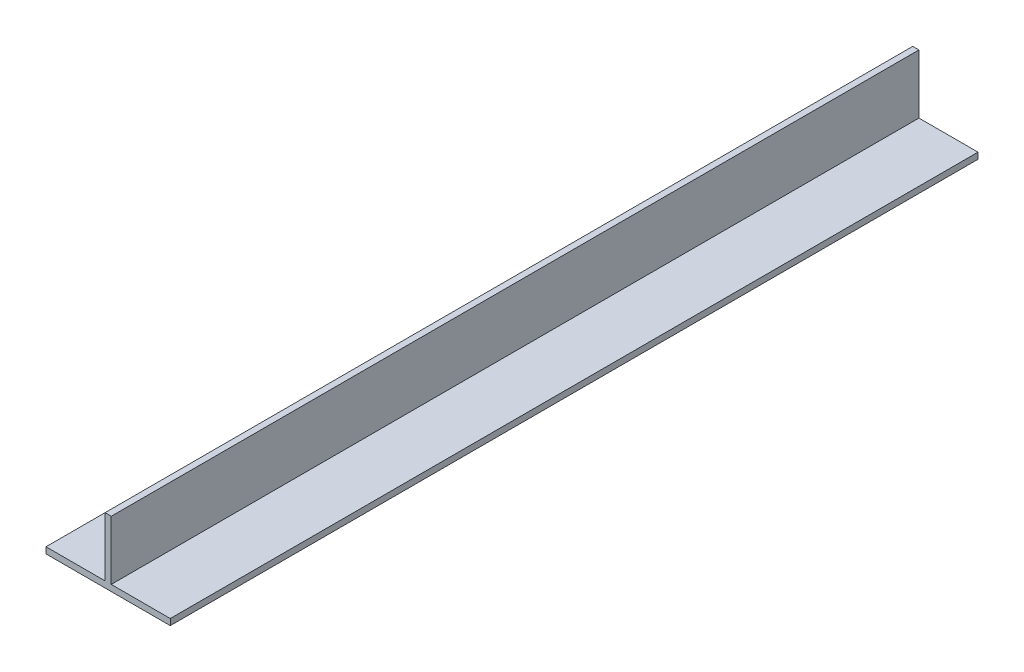
ISO-10303-21;
HEADER;
FILE_DESCRIPTION(('STEP AP214'),'2;1');
FILE_NAME('part.step','',(''),(''),'','','');
FILE_SCHEMA(('AUTOMOTIVE_DESIGN { 1 0 10303 214 1 1 1 1 }'));
ENDSEC;
DATA;
#1=APPLICATION_CONTEXT('core data for automotive mechanical design processes');
#2=APPLICATION_PROTOCOL_DEFINITION('international standard','automotive_design',2000,#1);
#3=PRODUCT_CONTEXT('',#1,'mechanical');
#4=PRODUCT('Part','Part','',(#3));
#5=PRODUCT_RELATED_PRODUCT_CATEGORY('part','',(#4));
#6=PRODUCT_DEFINITION_FORMATION('','',#4);
#7=PRODUCT_DEFINITION_CONTEXT('part definition',#1,'design');
#8=PRODUCT_DEFINITION('design','',#6,#7);
#9=PRODUCT_DEFINITION_SHAPE('','',#8);
#10=(LENGTH_UNIT() NAMED_UNIT(*) SI_UNIT(.MILLI.,.METRE.));
#11=(NAMED_UNIT(*) PLANE_ANGLE_UNIT() SI_UNIT($,.RADIAN.));
#12=(NAMED_UNIT(*) SI_UNIT($,.STERADIAN.) SOLID_ANGLE_UNIT());
#13=UNCERTAINTY_MEASURE_WITH_UNIT(LENGTH_MEASURE(1.E-05),#10,'distance_accuracy_value','');
#14=(GEOMETRIC_REPRESENTATION_CONTEXT(3) GLOBAL_UNCERTAINTY_ASSIGNED_CONTEXT((#13)) GLOBAL_UNIT_ASSIGNED_CONTEXT((#10,
#11,#12)) REPRESENTATION_CONTEXT('',''));
#15=CARTESIAN_POINT('',(0.,0.,0.));
#16=DIRECTION('',(0.,0.,1.));
#17=DIRECTION('',(1.,0.,0.));
#18=AXIS2_PLACEMENT_3D('',#15,#16,#17);
#19=CARTESIAN_POINT('',(10.,0.,65.));
#20=DIRECTION('',(-1.,0.,0.));
#21=DIRECTION('',(0.,0.,1.));
#22=AXIS2_PLACEMENT_3D('',#19,#20,#21);
#23=PLANE('',#22);
#24=DIRECTION('',(0.,1.,0.));
#25=VECTOR('',#24,1.);
#26=CARTESIAN_POINT('',(10.,0.,-65.));
#27=LINE('',#26,#25);
#28=CARTESIAN_POINT('',(10.,-1.,-65.));
#29=VERTEX_POINT('',#28);
#30=CARTESIAN_POINT('',(10.,0.,-65.));
#31=VERTEX_POINT('',#30);
#32=EDGE_CURVE('E128',#29,#31,#27,.T.);
#33=ORIENTED_EDGE('',*,*,#32,.T.);
#34=DIRECTION('',(0.,0.,-1.));
#35=VECTOR('',#34,1.);
#36=CARTESIAN_POINT('',(10.,0.,65.));
#37=LINE('',#36,#35);
#38=CARTESIAN_POINT('',(10.,0.,65.));
#39=VERTEX_POINT('',#38);
#40=EDGE_CURVE('E11',#39,#31,#37,.T.);
#41=ORIENTED_EDGE('',*,*,#40,.F.);
#42=DIRECTION('',(0.,1.,0.));
#43=VECTOR('',#42,1.);
#44=CARTESIAN_POINT('',(10.,0.,65.));
#45=LINE('',#44,#43);
#46=CARTESIAN_POINT('',(10.,-1.,65.));
#47=VERTEX_POINT('',#46);
#48=EDGE_CURVE('E142',#47,#39,#45,.T.);
#49=ORIENTED_EDGE('',*,*,#48,.F.);
#50=DIRECTION('',(0.,0.,-1.));
#51=VECTOR('',#50,1.);
#52=CARTESIAN_POINT('',(10.,-1.,65.));
#53=LINE('',#52,#51);
#54=EDGE_CURVE('E124',#47,#29,#53,.T.);
#55=ORIENTED_EDGE('',*,*,#54,.T.);
#56=EDGE_LOOP('',(#33,#41,#49,#55));
#57=FACE_BOUND('',#56,.T.);
#58=ADVANCED_FACE('F32',(#57),#23,.F.);
#59=CARTESIAN_POINT('',(0.500000000000002,0.,65.));
#60=DIRECTION('',(0.,-1.,0.));
#61=DIRECTION('',(1.,0.,0.));
#62=AXIS2_PLACEMENT_3D('',#59,#60,#61);
#63=PLANE('',#62);
#64=DIRECTION('',(-1.,0.,0.));
#65=VECTOR('',#64,1.);
#66=CARTESIAN_POINT('',(0.500000000000002,0.,-65.));
#67=LINE('',#66,#65);
#68=CARTESIAN_POINT('',(0.500000000000002,0.,-65.));
#69=VERTEX_POINT('',#68);
#70=EDGE_CURVE('E131',#31,#69,#67,.T.);
#71=ORIENTED_EDGE('',*,*,#70,.T.);
#72=DIRECTION('',(0.,0.,-1.));
#73=VECTOR('',#72,1.);
#74=CARTESIAN_POINT('',(0.500000000000002,0.,65.));
#75=LINE('',#74,#73);
#76=CARTESIAN_POINT('',(0.500000000000002,0.,65.));
#77=VERTEX_POINT('',#76);
#78=EDGE_CURVE('E40',#77,#69,#75,.T.);
#79=ORIENTED_EDGE('',*,*,#78,.F.);
#80=DIRECTION('',(-1.,0.,0.));
#81=VECTOR('',#80,1.);
#82=CARTESIAN_POINT('',(0.500000000000002,0.,65.));
#83=LINE('',#82,#81);
#84=EDGE_CURVE('E91',#39,#77,#83,.T.);
#85=ORIENTED_EDGE('',*,*,#84,.F.);
#86=ORIENTED_EDGE('',*,*,#40,.T.);
#87=EDGE_LOOP('',(#71,#79,#85,#86));
#88=FACE_BOUND('',#87,.T.);
#89=ADVANCED_FACE('F177',(#88),#63,.F.);
#90=CARTESIAN_POINT('',(0.500000000000002,0.,65.));
#91=DIRECTION('',(-1.,0.,0.));
#92=DIRECTION('',(0.,-1.,0.));
#93=AXIS2_PLACEMENT_3D('',#90,#91,#92);
#94=PLANE('',#93);
#95=DIRECTION('',(0.,1.,0.));
#96=VECTOR('',#95,1.);
#97=CARTESIAN_POINT('',(0.500000000000002,0.,-65.));
#98=LINE('',#97,#96);
#99=CARTESIAN_POINT('',(0.499999999999997,9.5,-65.));
#100=VERTEX_POINT('',#99);
#101=EDGE_CURVE('E133',#69,#100,#98,.T.);
#102=ORIENTED_EDGE('',*,*,#101,.T.);
#103=DIRECTION('',(0.,0.,-1.));
#104=VECTOR('',#103,1.);
#105=CARTESIAN_POINT('',(0.499999999999997,9.5,65.));
#106=LINE('',#105,#104);
#107=CARTESIAN_POINT('',(0.499999999999997,9.5,65.));
#108=VERTEX_POINT('',#107);
#109=EDGE_CURVE('E149',#108,#100,#106,.T.);
#110=ORIENTED_EDGE('',*,*,#109,.F.);
#111=DIRECTION('',(0.,1.,0.));
#112=VECTOR('',#111,1.);
#113=CARTESIAN_POINT('',(0.500000000000002,0.,65.));
#114=LINE('',#113,#112);
#115=EDGE_CURVE('E157',#77,#108,#114,.T.);
#116=ORIENTED_EDGE('',*,*,#115,.F.);
#117=ORIENTED_EDGE('',*,*,#78,.T.);
#118=EDGE_LOOP('',(#102,#110,#116,#117));
#119=FACE_BOUND('',#118,.T.);
#120=ADVANCED_FACE('F155',(#119),#94,.F.);
#121=CARTESIAN_POINT('',(-0.500000000000002,9.5,65.));
#122=DIRECTION('',(0.,-1.,0.));
#123=DIRECTION('',(0.,0.,-1.));
#124=AXIS2_PLACEMENT_3D('',#121,#122,#123);
#125=PLANE('',#124);
#126=DIRECTION('',(-1.,0.,0.));
#127=VECTOR('',#126,1.);
#128=CARTESIAN_POINT('',(-0.500000000000002,9.5,-65.));
#129=LINE('',#128,#127);
#130=CARTESIAN_POINT('',(-0.500000000000002,9.5,-65.));
#131=VERTEX_POINT('',#130);
#132=EDGE_CURVE('E135',#100,#131,#129,.T.);
#133=ORIENTED_EDGE('',*,*,#132,.T.);
#134=DIRECTION('',(0.,0.,-1.));
#135=VECTOR('',#134,1.);
#136=CARTESIAN_POINT('',(-0.500000000000002,9.5,65.));
#137=LINE('',#136,#135);
#138=CARTESIAN_POINT('',(-0.500000000000002,9.5,65.));
#139=VERTEX_POINT('',#138);
#140=EDGE_CURVE('E146',#139,#131,#137,.T.);
#141=ORIENTED_EDGE('',*,*,#140,.F.);
#142=DIRECTION('',(-1.,0.,0.));
#143=VECTOR('',#142,1.);
#144=CARTESIAN_POINT('',(-0.500000000000002,9.5,65.));
#145=LINE('',#144,#143);
#146=EDGE_CURVE('E169',#108,#139,#145,.T.);
#147=ORIENTED_EDGE('',*,*,#146,.F.);
#148=ORIENTED_EDGE('',*,*,#109,.T.);
#149=EDGE_LOOP('',(#133,#141,#147,#148));
#150=FACE_BOUND('',#149,.T.);
#151=ADVANCED_FACE('F165',(#150),#125,.F.);
#152=CARTESIAN_POINT('',(-0.5,0.,65.));
#153=DIRECTION('',(1.,0.,0.));
#154=DIRECTION('',(0.,1.,0.));
#155=AXIS2_PLACEMENT_3D('',#152,#153,#154);
#156=PLANE('',#155);
#157=DIRECTION('',(0.,-1.,0.));
#158=VECTOR('',#157,1.);
#159=CARTESIAN_POINT('',(-0.5,0.,-65.));
#160=LINE('',#159,#158);
#161=CARTESIAN_POINT('',(-0.5,0.,-65.));
#162=VERTEX_POINT('',#161);
#163=EDGE_CURVE('E137',#131,#162,#160,.T.);
#164=ORIENTED_EDGE('',*,*,#163,.T.);
#165=DIRECTION('',(0.,0.,-1.));
#166=VECTOR('',#165,1.);
#167=CARTESIAN_POINT('',(-0.5,0.,65.));
#168=LINE('',#167,#166);
#169=CARTESIAN_POINT('',(-0.5,0.,65.));
#170=VERTEX_POINT('',#169);
#171=EDGE_CURVE('E119',#170,#162,#168,.T.);
#172=ORIENTED_EDGE('',*,*,#171,.F.);
#173=DIRECTION('',(0.,-1.,0.));
#174=VECTOR('',#173,1.);
#175=CARTESIAN_POINT('',(-0.5,0.,65.));
#176=LINE('',#175,#174);
#177=EDGE_CURVE('E110',#139,#170,#176,.T.);
#178=ORIENTED_EDGE('',*,*,#177,.F.);
#179=ORIENTED_EDGE('',*,*,#140,.T.);
#180=EDGE_LOOP('',(#164,#172,#178,#179));
#181=FACE_BOUND('',#180,.T.);
#182=ADVANCED_FACE('F168',(#181),#156,.F.);
#183=CARTESIAN_POINT('',(-10.,0.,65.));
#184=DIRECTION('',(0.,-1.,0.));
#185=DIRECTION('',(0.,0.,-1.));
#186=AXIS2_PLACEMENT_3D('',#183,#184,#185);
#187=PLANE('',#186);
#188=DIRECTION('',(-1.,0.,0.));
#189=VECTOR('',#188,1.);
#190=CARTESIAN_POINT('',(-10.,0.,-65.));
#191=LINE('',#190,#189);
#192=CARTESIAN_POINT('',(-10.,0.,-65.));
#193=VERTEX_POINT('',#192);
#194=EDGE_CURVE('E118',#162,#193,#191,.T.);
#195=ORIENTED_EDGE('',*,*,#194,.T.);
#196=DIRECTION('',(0.,0.,-1.));
#197=VECTOR('',#196,1.);
#198=CARTESIAN_POINT('',(-10.,0.,65.));
#199=LINE('',#198,#197);
#200=CARTESIAN_POINT('',(-10.,0.,65.));
#201=VERTEX_POINT('',#200);
#202=EDGE_CURVE('E115',#201,#193,#199,.T.);
#203=ORIENTED_EDGE('',*,*,#202,.F.);
#204=DIRECTION('',(-1.,0.,0.));
#205=VECTOR('',#204,1.);
#206=CARTESIAN_POINT('',(-10.,0.,65.));
#207=LINE('',#206,#205);
#208=EDGE_CURVE('E104',#170,#201,#207,.T.);
#209=ORIENTED_EDGE('',*,*,#208,.F.);
#210=ORIENTED_EDGE('',*,*,#171,.T.);
#211=EDGE_LOOP('',(#195,#203,#209,#210));
#212=FACE_BOUND('',#211,.T.);
#213=ADVANCED_FACE('F116',(#212),#187,.F.);
#214=CARTESIAN_POINT('',(-10.,0.,65.));
#215=DIRECTION('',(1.,0.,0.));
#216=DIRECTION('',(0.,0.,-1.));
#217=AXIS2_PLACEMENT_3D('',#214,#215,#216);
#218=PLANE('',#217);
#219=DIRECTION('',(0.,-1.,0.));
#220=VECTOR('',#219,1.);
#221=CARTESIAN_POINT('',(-10.,0.,-65.));
#222=LINE('',#221,#220);
#223=CARTESIAN_POINT('',(-10.,-1.,-65.));
#224=VERTEX_POINT('',#223);
#225=EDGE_CURVE('E77',#193,#224,#222,.T.);
#226=ORIENTED_EDGE('',*,*,#225,.T.);
#227=DIRECTION('',(0.,0.,-1.));
#228=VECTOR('',#227,1.);
#229=CARTESIAN_POINT('',(-10.,-1.,65.));
#230=LINE('',#229,#228);
#231=CARTESIAN_POINT('',(-10.,-1.,65.));
#232=VERTEX_POINT('',#231);
#233=EDGE_CURVE('E120',#232,#224,#230,.T.);
#234=ORIENTED_EDGE('',*,*,#233,.F.);
#235=DIRECTION('',(0.,-1.,0.));
#236=VECTOR('',#235,1.);
#237=CARTESIAN_POINT('',(-10.,0.,65.));
#238=LINE('',#237,#236);
#239=EDGE_CURVE('E108',#201,#232,#238,.T.);
#240=ORIENTED_EDGE('',*,*,#239,.F.);
#241=ORIENTED_EDGE('',*,*,#202,.T.);
#242=EDGE_LOOP('',(#226,#234,#240,#241));
#243=FACE_BOUND('',#242,.T.);
#244=ADVANCED_FACE('F122',(#243),#218,.F.);
#245=CARTESIAN_POINT('',(-10.,-1.,65.));
#246=DIRECTION('',(0.,1.,0.));
#247=DIRECTION('',(0.,0.,1.));
#248=AXIS2_PLACEMENT_3D('',#245,#246,#247);
#249=PLANE('',#248);
#250=DIRECTION('',(1.,0.,0.));
#251=VECTOR('',#250,1.);
#252=CARTESIAN_POINT('',(-10.,-1.,-65.));
#253=LINE('',#252,#251);
#254=EDGE_CURVE('E83',#224,#29,#253,.T.);
#255=ORIENTED_EDGE('',*,*,#254,.T.);
#256=ORIENTED_EDGE('',*,*,#54,.F.);
#257=DIRECTION('',(1.,0.,0.));
#258=VECTOR('',#257,1.);
#259=CARTESIAN_POINT('',(-10.,-1.,65.));
#260=LINE('',#259,#258);
#261=EDGE_CURVE('E48',#232,#47,#260,.T.);
#262=ORIENTED_EDGE('',*,*,#261,.F.);
#263=ORIENTED_EDGE('',*,*,#233,.T.);
#264=EDGE_LOOP('',(#255,#256,#262,#263));
#265=FACE_BOUND('',#264,.T.);
#266=ADVANCED_FACE('F193',(#265),#249,.F.);
#267=CARTESIAN_POINT('',(0.,0.,65.));
#268=DIRECTION('',(0.,0.,1.));
#269=DIRECTION('',(1.,0.,0.));
#270=AXIS2_PLACEMENT_3D('',#267,#268,#269);
#271=PLANE('',#270);
#272=ORIENTED_EDGE('',*,*,#48,.T.);
#273=ORIENTED_EDGE('',*,*,#84,.T.);
#274=ORIENTED_EDGE('',*,*,#115,.T.);
#275=ORIENTED_EDGE('',*,*,#146,.T.);
#276=ORIENTED_EDGE('',*,*,#177,.T.);
#277=ORIENTED_EDGE('',*,*,#208,.T.);
#278=ORIENTED_EDGE('',*,*,#239,.T.);
#279=ORIENTED_EDGE('',*,*,#261,.T.);
#280=EDGE_LOOP('',(#272,#273,#274,#275,#276,#277,#278,#279));
#281=FACE_BOUND('',#280,.T.);
#282=ADVANCED_FACE('F106',(#281),#271,.T.);
#283=CARTESIAN_POINT('',(0.,0.,-65.));
#284=DIRECTION('',(0.,0.,1.));
#285=DIRECTION('',(1.,0.,0.));
#286=AXIS2_PLACEMENT_3D('',#283,#284,#285);
#287=PLANE('',#286);
#288=ORIENTED_EDGE('',*,*,#32,.F.);
#289=ORIENTED_EDGE('',*,*,#254,.F.);
#290=ORIENTED_EDGE('',*,*,#225,.F.);
#291=ORIENTED_EDGE('',*,*,#194,.F.);
#292=ORIENTED_EDGE('',*,*,#163,.F.);
#293=ORIENTED_EDGE('',*,*,#132,.F.);
#294=ORIENTED_EDGE('',*,*,#101,.F.);
#295=ORIENTED_EDGE('',*,*,#70,.F.);
#296=EDGE_LOOP('',(#288,#289,#290,#291,#292,#293,#294,#295));
#297=FACE_BOUND('',#296,.T.);
#298=ADVANCED_FACE('F161',(#297),#287,.F.);
#299=CLOSED_SHELL('',(#58,#89,#120,#151,#182,#213,#244,#266,#282,#298));
#300=MANIFOLD_SOLID_BREP('B2',#299);
#301=ADVANCED_BREP_SHAPE_REPRESENTATION('',(#18,#300),#14);
#302=SHAPE_DEFINITION_REPRESENTATION(#9,#301);
ENDSEC;
END-ISO-10303-21;
